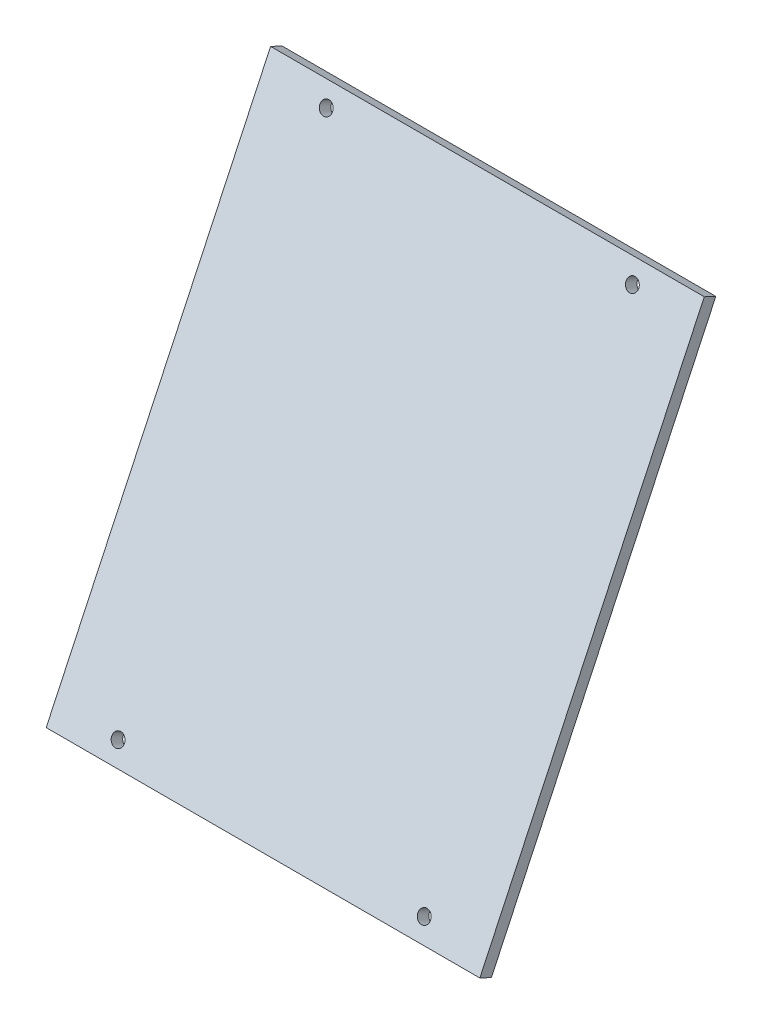
ISO-10303-21;
HEADER;
FILE_DESCRIPTION(('STEP AP214'),'2;1');
FILE_NAME('part.step','',(''),(''),'','','');
FILE_SCHEMA(('AUTOMOTIVE_DESIGN { 1 0 10303 214 1 1 1 1 }'));
ENDSEC;
DATA;
#1=APPLICATION_CONTEXT('core data for automotive mechanical design processes');
#2=APPLICATION_PROTOCOL_DEFINITION('international standard','automotive_design',2000,#1);
#3=PRODUCT_CONTEXT('',#1,'mechanical');
#4=PRODUCT('Part','Part','',(#3));
#5=PRODUCT_RELATED_PRODUCT_CATEGORY('part','',(#4));
#6=PRODUCT_DEFINITION_FORMATION('','',#4);
#7=PRODUCT_DEFINITION_CONTEXT('part definition',#1,'design');
#8=PRODUCT_DEFINITION('design','',#6,#7);
#9=PRODUCT_DEFINITION_SHAPE('','',#8);
#10=(LENGTH_UNIT() NAMED_UNIT(*) SI_UNIT(.MILLI.,.METRE.));
#11=(NAMED_UNIT(*) PLANE_ANGLE_UNIT() SI_UNIT($,.RADIAN.));
#12=(NAMED_UNIT(*) SI_UNIT($,.STERADIAN.) SOLID_ANGLE_UNIT());
#13=UNCERTAINTY_MEASURE_WITH_UNIT(LENGTH_MEASURE(1.E-05),#10,'distance_accuracy_value','');
#14=(GEOMETRIC_REPRESENTATION_CONTEXT(3) GLOBAL_UNCERTAINTY_ASSIGNED_CONTEXT((#13)) GLOBAL_UNIT_ASSIGNED_CONTEXT((#10,
#11,#12)) REPRESENTATION_CONTEXT('',''));
#15=CARTESIAN_POINT('',(0.,0.,0.));
#16=DIRECTION('',(0.,0.,1.));
#17=DIRECTION('',(1.,0.,0.));
#18=AXIS2_PLACEMENT_3D('',#15,#16,#17);
#19=CARTESIAN_POINT('',(215.9,2.69992848606173,5.74742430747482));
#20=DIRECTION('',(0.,0.905106190153515,-0.425185588356178));
#21=DIRECTION('',(0.,0.425185588356178,0.905106190153515));
#22=AXIS2_PLACEMENT_3D('',#19,#20,#21);
#23=PLANE('',#22);
#24=DIRECTION('',(0.,-0.425185588356178,-0.905106190153515));
#25=VECTOR('',#24,1.);
#26=CARTESIAN_POINT('',(0.,2.69992848606173,5.74742430747482));
#27=LINE('',#26,#25);
#28=CARTESIAN_POINT('',(0.,2.69992848606173,5.74742430747482));
#29=VERTEX_POINT('',#28);
#30=CARTESIAN_POINT('',(0.,0.,0.));
#31=VERTEX_POINT('',#30);
#32=EDGE_CURVE('E97',#29,#31,#27,.T.);
#33=ORIENTED_EDGE('',*,*,#32,.T.);
#34=DIRECTION('',(-1.,0.,0.));
#35=VECTOR('',#34,1.);
#36=CARTESIAN_POINT('',(215.9,0.,0.));
#37=LINE('',#36,#35);
#38=CARTESIAN_POINT('',(215.9,0.,0.));
#39=VERTEX_POINT('',#38);
#40=EDGE_CURVE('E11',#39,#31,#37,.T.);
#41=ORIENTED_EDGE('',*,*,#40,.F.);
#42=DIRECTION('',(0.,-0.425185588356178,-0.905106190153515));
#43=VECTOR('',#42,1.);
#44=CARTESIAN_POINT('',(215.9,2.69992848606173,5.74742430747482));
#45=LINE('',#44,#43);
#46=CARTESIAN_POINT('',(215.9,2.69992848606173,5.74742430747482));
#47=VERTEX_POINT('',#46);
#48=EDGE_CURVE('E85',#47,#39,#45,.T.);
#49=ORIENTED_EDGE('',*,*,#48,.F.);
#50=DIRECTION('',(-1.,0.,0.));
#51=VECTOR('',#50,1.);
#52=CARTESIAN_POINT('',(215.9,2.69992848606173,5.74742430747482));
#53=LINE('',#52,#51);
#54=EDGE_CURVE('E93',#47,#29,#53,.T.);
#55=ORIENTED_EDGE('',*,*,#54,.T.);
#56=EDGE_LOOP('',(#33,#41,#49,#55));
#57=FACE_BOUND('',#56,.T.);
#58=ADVANCED_FACE('F34',(#57),#23,.F.);
#59=CARTESIAN_POINT('',(215.9,0.,0.));
#60=DIRECTION('',(0.,0.425185588356169,0.905106190153519));
#61=DIRECTION('',(0.,-0.905106190153519,0.425185588356169));
#62=AXIS2_PLACEMENT_3D('',#59,#60,#61);
#63=PLANE('',#62);
#64=CARTESIAN_POINT('',(31.75,229.216935052726,-107.677682963433));
#65=DIRECTION('',(0.,0.425185588356169,0.905106190153519));
#66=DIRECTION('',(0.,-0.905106190153519,0.425185588356169));
#67=AXIS2_PLACEMENT_3D('',#64,#65,#66);
#68=CIRCLE('',#67,3.17499999999998);
#69=CARTESIAN_POINT('',(31.75,226.343222898989,-106.327718720402));
#70=VERTEX_POINT('',#69);
#71=EDGE_CURVE('E128',#70,#70,#68,.T.);
#72=ORIENTED_EDGE('',*,*,#71,.T.);
#73=EDGE_LOOP('',(#72));
#74=FACE_BOUND('',#73,.T.);
#75=CARTESIAN_POINT('',(184.15,229.216935052726,-107.677682963433));
#76=DIRECTION('',(0.,0.425185588356169,0.905106190153519));
#77=DIRECTION('',(0.,-0.905106190153519,0.425185588356169));
#78=AXIS2_PLACEMENT_3D('',#75,#76,#77);
#79=CIRCLE('',#78,3.17499999999998);
#80=CARTESIAN_POINT('',(184.15,226.343222898989,-106.327718720402));
#81=VERTEX_POINT('',#80);
#82=EDGE_CURVE('E122',#81,#81,#79,.T.);
#83=ORIENTED_EDGE('',*,*,#82,.T.);
#84=EDGE_LOOP('',(#83));
#85=FACE_BOUND('',#84,.T.);
#86=CARTESIAN_POINT('',(184.15,8.62113646121233,-4.04989272909253));
#87=DIRECTION('',(0.,0.425185588356169,0.905106190153519));
#88=DIRECTION('',(0.,-0.905106190153519,0.425185588356169));
#89=AXIS2_PLACEMENT_3D('',#86,#87,#88);
#90=CIRCLE('',#89,3.17499999999998);
#91=CARTESIAN_POINT('',(184.15,5.74742430747492,-2.6999284860617));
#92=VERTEX_POINT('',#91);
#93=EDGE_CURVE('E116',#92,#92,#90,.T.);
#94=ORIENTED_EDGE('',*,*,#93,.T.);
#95=EDGE_LOOP('',(#94));
#96=FACE_BOUND('',#95,.T.);
#97=CARTESIAN_POINT('',(31.75,8.62113646121233,-4.04989272909253));
#98=DIRECTION('',(0.,0.425185588356169,0.905106190153519));
#99=DIRECTION('',(0.,-0.905106190153519,0.425185588356169));
#100=AXIS2_PLACEMENT_3D('',#97,#98,#99);
#101=CIRCLE('',#100,3.17499999999998);
#102=CARTESIAN_POINT('',(31.75,5.74742430747492,-2.6999284860617));
#103=VERTEX_POINT('',#102);
#104=EDGE_CURVE('E100',#103,#103,#101,.T.);
#105=ORIENTED_EDGE('',*,*,#104,.T.);
#106=EDGE_LOOP('',(#105));
#107=FACE_BOUND('',#106,.T.);
#108=DIRECTION('',(0.,0.905106190153519,-0.425185588356169));
#109=VECTOR('',#108,1.);
#110=CARTESIAN_POINT('',(0.,0.,0.));
#111=LINE('',#110,#109);
#112=CARTESIAN_POINT('',(0.,237.838071513938,-111.727575692525));
#113=VERTEX_POINT('',#112);
#114=EDGE_CURVE('E89',#31,#113,#111,.T.);
#115=ORIENTED_EDGE('',*,*,#114,.T.);
#116=DIRECTION('',(-1.,0.,0.));
#117=VECTOR('',#116,1.);
#118=CARTESIAN_POINT('',(215.9,237.838071513938,-111.727575692525));
#119=LINE('',#118,#117);
#120=CARTESIAN_POINT('',(215.9,237.838071513938,-111.727575692525));
#121=VERTEX_POINT('',#120);
#122=EDGE_CURVE('E42',#121,#113,#119,.T.);
#123=ORIENTED_EDGE('',*,*,#122,.F.);
#124=DIRECTION('',(0.,0.905106190153519,-0.425185588356169));
#125=VECTOR('',#124,1.);
#126=CARTESIAN_POINT('',(215.9,0.,0.));
#127=LINE('',#126,#125);
#128=EDGE_CURVE('E80',#39,#121,#127,.T.);
#129=ORIENTED_EDGE('',*,*,#128,.F.);
#130=ORIENTED_EDGE('',*,*,#40,.T.);
#131=EDGE_LOOP('',(#115,#123,#129,#130));
#132=FACE_BOUND('',#131,.T.);
#133=ADVANCED_FACE('F88',(#74,#85,#96,#107,#132),#63,.F.);
#134=CARTESIAN_POINT('',(215.9,237.838071513938,-111.727575692525));
#135=DIRECTION('',(0.,-0.905106190153515,0.425185588356178));
#136=DIRECTION('',(0.,-0.425185588356178,-0.905106190153515));
#137=AXIS2_PLACEMENT_3D('',#134,#135,#136);
#138=PLANE('',#137);
#139=DIRECTION('',(0.,0.425185588356178,0.905106190153515));
#140=VECTOR('',#139,1.);
#141=CARTESIAN_POINT('',(0.,237.838071513938,-111.727575692525));
#142=LINE('',#141,#140);
#143=CARTESIAN_POINT('',(0.,240.538,-105.98015138505));
#144=VERTEX_POINT('',#143);
#145=EDGE_CURVE('E67',#113,#144,#142,.T.);
#146=ORIENTED_EDGE('',*,*,#145,.T.);
#147=DIRECTION('',(-1.,0.,0.));
#148=VECTOR('',#147,1.);
#149=CARTESIAN_POINT('',(215.9,240.538,-105.98015138505));
#150=LINE('',#149,#148);
#151=CARTESIAN_POINT('',(215.9,240.538,-105.98015138505));
#152=VERTEX_POINT('',#151);
#153=EDGE_CURVE('E90',#152,#144,#150,.T.);
#154=ORIENTED_EDGE('',*,*,#153,.F.);
#155=DIRECTION('',(0.,0.425185588356178,0.905106190153515));
#156=VECTOR('',#155,1.);
#157=CARTESIAN_POINT('',(215.9,237.838071513938,-111.727575692525));
#158=LINE('',#157,#156);
#159=EDGE_CURVE('E83',#121,#152,#158,.T.);
#160=ORIENTED_EDGE('',*,*,#159,.F.);
#161=ORIENTED_EDGE('',*,*,#122,.T.);
#162=EDGE_LOOP('',(#146,#154,#160,#161));
#163=FACE_BOUND('',#162,.T.);
#164=ADVANCED_FACE('F91',(#163),#138,.F.);
#165=CARTESIAN_POINT('',(215.9,240.538,-105.98015138505));
#166=DIRECTION('',(0.,-0.425185588356169,-0.905106190153519));
#167=DIRECTION('',(0.,0.905106190153519,-0.425185588356169));
#168=AXIS2_PLACEMENT_3D('',#165,#166,#167);
#169=PLANE('',#168);
#170=CARTESIAN_POINT('',(31.75,231.916863538788,-101.930258655958));
#171=DIRECTION('',(0.,0.425185588356169,0.905106190153519));
#172=DIRECTION('',(0.,-0.905106190153519,0.425185588356169));
#173=AXIS2_PLACEMENT_3D('',#170,#171,#172);
#174=CIRCLE('',#173,3.17499999999998);
#175=CARTESIAN_POINT('',(31.75,229.04315138505,-100.580294412927));
#176=VERTEX_POINT('',#175);
#177=EDGE_CURVE('E131',#176,#176,#174,.T.);
#178=ORIENTED_EDGE('',*,*,#177,.F.);
#179=EDGE_LOOP('',(#178));
#180=FACE_BOUND('',#179,.T.);
#181=CARTESIAN_POINT('',(184.15,231.916863538788,-101.930258655958));
#182=DIRECTION('',(0.,0.425185588356169,0.905106190153519));
#183=DIRECTION('',(0.,-0.905106190153519,0.425185588356169));
#184=AXIS2_PLACEMENT_3D('',#181,#182,#183);
#185=CIRCLE('',#184,3.17499999999998);
#186=CARTESIAN_POINT('',(184.15,229.04315138505,-100.580294412927));
#187=VERTEX_POINT('',#186);
#188=EDGE_CURVE('E125',#187,#187,#185,.T.);
#189=ORIENTED_EDGE('',*,*,#188,.F.);
#190=EDGE_LOOP('',(#189));
#191=FACE_BOUND('',#190,.T.);
#192=CARTESIAN_POINT('',(184.15,11.321064947274,1.69753157838232));
#193=DIRECTION('',(0.,0.425185588356169,0.905106190153519));
#194=DIRECTION('',(0.,-0.905106190153519,0.425185588356169));
#195=AXIS2_PLACEMENT_3D('',#192,#193,#194);
#196=CIRCLE('',#195,3.17499999999998);
#197=CARTESIAN_POINT('',(184.15,8.4473527935366,3.04749582141315));
#198=VERTEX_POINT('',#197);
#199=EDGE_CURVE('E119',#198,#198,#196,.T.);
#200=ORIENTED_EDGE('',*,*,#199,.F.);
#201=EDGE_LOOP('',(#200));
#202=FACE_BOUND('',#201,.T.);
#203=CARTESIAN_POINT('',(31.75,11.321064947274,1.69753157838232));
#204=DIRECTION('',(0.,0.425185588356169,0.905106190153519));
#205=DIRECTION('',(0.,-0.905106190153519,0.425185588356169));
#206=AXIS2_PLACEMENT_3D('',#203,#204,#205);
#207=CIRCLE('',#206,3.17499999999998);
#208=CARTESIAN_POINT('',(31.75,8.4473527935366,3.04749582141315));
#209=VERTEX_POINT('',#208);
#210=EDGE_CURVE('E113',#209,#209,#207,.T.);
#211=ORIENTED_EDGE('',*,*,#210,.F.);
#212=EDGE_LOOP('',(#211));
#213=FACE_BOUND('',#212,.T.);
#214=DIRECTION('',(0.,-0.905106190153519,0.425185588356169));
#215=VECTOR('',#214,1.);
#216=CARTESIAN_POINT('',(0.,240.538,-105.98015138505));
#217=LINE('',#216,#215);
#218=EDGE_CURVE('E73',#144,#29,#217,.T.);
#219=ORIENTED_EDGE('',*,*,#218,.T.);
#220=ORIENTED_EDGE('',*,*,#54,.F.);
#221=DIRECTION('',(0.,-0.905106190153519,0.425185588356169));
#222=VECTOR('',#221,1.);
#223=CARTESIAN_POINT('',(215.9,240.538,-105.98015138505));
#224=LINE('',#223,#222);
#225=EDGE_CURVE('E50',#152,#47,#224,.T.);
#226=ORIENTED_EDGE('',*,*,#225,.F.);
#227=ORIENTED_EDGE('',*,*,#153,.T.);
#228=EDGE_LOOP('',(#219,#220,#226,#227));
#229=FACE_BOUND('',#228,.T.);
#230=ADVANCED_FACE('F105',(#180,#191,#202,#213,#229),#169,.F.);
#231=CARTESIAN_POINT('',(215.9,0.,0.));
#232=DIRECTION('',(1.,0.,0.));
#233=DIRECTION('',(0.,0.,-1.));
#234=AXIS2_PLACEMENT_3D('',#231,#232,#233);
#235=PLANE('',#234);
#236=ORIENTED_EDGE('',*,*,#48,.T.);
#237=ORIENTED_EDGE('',*,*,#128,.T.);
#238=ORIENTED_EDGE('',*,*,#159,.T.);
#239=ORIENTED_EDGE('',*,*,#225,.T.);
#240=EDGE_LOOP('',(#236,#237,#238,#239));
#241=FACE_BOUND('',#240,.T.);
#242=ADVANCED_FACE('F81',(#241),#235,.T.);
#243=CARTESIAN_POINT('',(0.,0.,0.));
#244=DIRECTION('',(1.,0.,0.));
#245=DIRECTION('',(0.,0.,-1.));
#246=AXIS2_PLACEMENT_3D('',#243,#244,#245);
#247=PLANE('',#246);
#248=ORIENTED_EDGE('',*,*,#32,.F.);
#249=ORIENTED_EDGE('',*,*,#218,.F.);
#250=ORIENTED_EDGE('',*,*,#145,.F.);
#251=ORIENTED_EDGE('',*,*,#114,.F.);
#252=EDGE_LOOP('',(#248,#249,#250,#251));
#253=FACE_BOUND('',#252,.T.);
#254=ADVANCED_FACE('F108',(#253),#247,.F.);
#255=CARTESIAN_POINT('',(31.75,11.321064947274,1.69753157838232));
#256=DIRECTION('',(0.,0.425185588356169,0.905106190153519));
#257=DIRECTION('',(0.,-0.905106190153519,0.425185588356169));
#258=AXIS2_PLACEMENT_3D('',#255,#256,#257);
#259=CYLINDRICAL_SURFACE('',#258,3.17499999999998);
#260=ORIENTED_EDGE('',*,*,#210,.T.);
#261=EDGE_LOOP('',(#260));
#262=FACE_BOUND('',#261,.T.);
#263=ORIENTED_EDGE('',*,*,#104,.F.);
#264=EDGE_LOOP('',(#263));
#265=FACE_BOUND('',#264,.T.);
#266=ADVANCED_FACE('F147',(#262,#265),#259,.F.);
#267=CARTESIAN_POINT('',(184.15,11.321064947274,1.69753157838232));
#268=DIRECTION('',(0.,0.425185588356169,0.905106190153519));
#269=DIRECTION('',(0.,-0.905106190153519,0.425185588356169));
#270=AXIS2_PLACEMENT_3D('',#267,#268,#269);
#271=CYLINDRICAL_SURFACE('',#270,3.17499999999998);
#272=ORIENTED_EDGE('',*,*,#199,.T.);
#273=EDGE_LOOP('',(#272));
#274=FACE_BOUND('',#273,.T.);
#275=ORIENTED_EDGE('',*,*,#93,.F.);
#276=EDGE_LOOP('',(#275));
#277=FACE_BOUND('',#276,.T.);
#278=ADVANCED_FACE('F150',(#274,#277),#271,.F.);
#279=CARTESIAN_POINT('',(184.15,231.916863538788,-101.930258655958));
#280=DIRECTION('',(0.,0.425185588356169,0.905106190153519));
#281=DIRECTION('',(0.,-0.905106190153519,0.425185588356169));
#282=AXIS2_PLACEMENT_3D('',#279,#280,#281);
#283=CYLINDRICAL_SURFACE('',#282,3.17499999999998);
#284=ORIENTED_EDGE('',*,*,#188,.T.);
#285=EDGE_LOOP('',(#284));
#286=FACE_BOUND('',#285,.T.);
#287=ORIENTED_EDGE('',*,*,#82,.F.);
#288=EDGE_LOOP('',(#287));
#289=FACE_BOUND('',#288,.T.);
#290=ADVANCED_FACE('F169',(#286,#289),#283,.F.);
#291=CARTESIAN_POINT('',(31.75,231.916863538788,-101.930258655958));
#292=DIRECTION('',(0.,0.425185588356169,0.905106190153519));
#293=DIRECTION('',(0.,-0.905106190153519,0.425185588356169));
#294=AXIS2_PLACEMENT_3D('',#291,#292,#293);
#295=CYLINDRICAL_SURFACE('',#294,3.17499999999998);
#296=ORIENTED_EDGE('',*,*,#177,.T.);
#297=EDGE_LOOP('',(#296));
#298=FACE_BOUND('',#297,.T.);
#299=ORIENTED_EDGE('',*,*,#71,.F.);
#300=EDGE_LOOP('',(#299));
#301=FACE_BOUND('',#300,.T.);
#302=ADVANCED_FACE('F135',(#298,#301),#295,.F.);
#303=CLOSED_SHELL('',(#58,#133,#164,#230,#242,#254,#266,#278,#290,#302));
#304=MANIFOLD_SOLID_BREP('B2',#303);
#305=ADVANCED_BREP_SHAPE_REPRESENTATION('',(#18,#304),#14);
#306=SHAPE_DEFINITION_REPRESENTATION(#9,#305);
ENDSEC;
END-ISO-10303-21;
